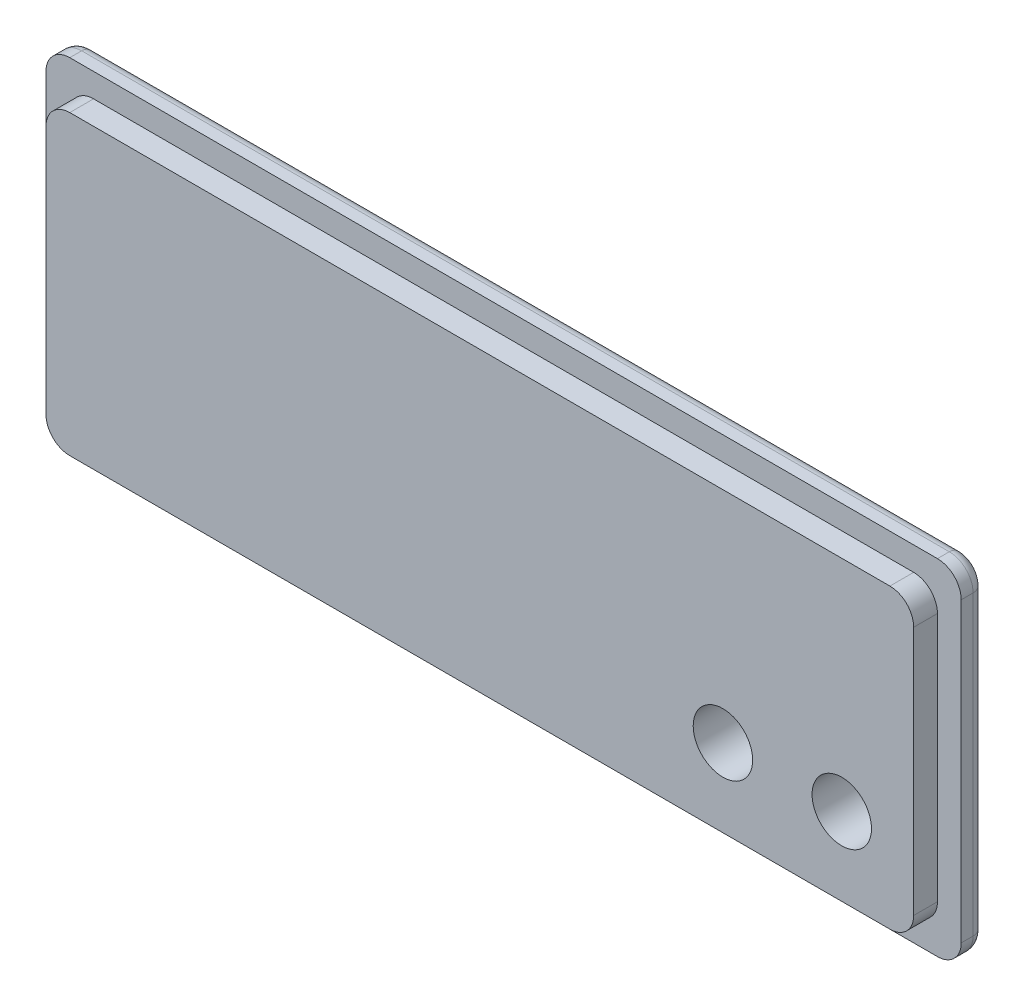
ISO-10303-21;
HEADER;
FILE_DESCRIPTION(('STEP AP214'),'2;1');
FILE_NAME('part.step','',(''),(''),'','','');
FILE_SCHEMA(('AUTOMOTIVE_DESIGN { 1 0 10303 214 1 1 1 1 }'));
ENDSEC;
DATA;
#1=APPLICATION_CONTEXT('core data for automotive mechanical design processes');
#2=APPLICATION_PROTOCOL_DEFINITION('international standard','automotive_design',2000,#1);
#3=PRODUCT_CONTEXT('',#1,'mechanical');
#4=PRODUCT('Part','Part','',(#3));
#5=PRODUCT_RELATED_PRODUCT_CATEGORY('part','',(#4));
#6=PRODUCT_DEFINITION_FORMATION('','',#4);
#7=PRODUCT_DEFINITION_CONTEXT('part definition',#1,'design');
#8=PRODUCT_DEFINITION('design','',#6,#7);
#9=PRODUCT_DEFINITION_SHAPE('','',#8);
#10=(LENGTH_UNIT() NAMED_UNIT(*) SI_UNIT(.MILLI.,.METRE.));
#11=(NAMED_UNIT(*) PLANE_ANGLE_UNIT() SI_UNIT($,.RADIAN.));
#12=(NAMED_UNIT(*) SI_UNIT($,.STERADIAN.) SOLID_ANGLE_UNIT());
#13=UNCERTAINTY_MEASURE_WITH_UNIT(LENGTH_MEASURE(1.E-05),#10,'distance_accuracy_value','');
#14=(GEOMETRIC_REPRESENTATION_CONTEXT(3) GLOBAL_UNCERTAINTY_ASSIGNED_CONTEXT((#13)) GLOBAL_UNIT_ASSIGNED_CONTEXT((#10,
#11,#12)) REPRESENTATION_CONTEXT('',''));
#15=CARTESIAN_POINT('',(0.,0.,0.));
#16=DIRECTION('',(0.,0.,1.));
#17=DIRECTION('',(1.,0.,0.));
#18=AXIS2_PLACEMENT_3D('',#15,#16,#17);
#19=CARTESIAN_POINT('',(36.5,-12.5,2.));
#20=DIRECTION('',(0.,0.,1.));
#21=DIRECTION('',(1.,0.,0.));
#22=AXIS2_PLACEMENT_3D('',#19,#20,#21);
#23=PLANE('',#22);
#24=CARTESIAN_POINT('',(36.5,-12.5,2.));
#25=DIRECTION('',(0.,0.,1.));
#26=DIRECTION('',(1.,0.,0.));
#27=AXIS2_PLACEMENT_3D('',#24,#25,#26);
#28=CIRCLE('',#27,2.);
#29=CARTESIAN_POINT('',(36.5,-14.5,2.));
#30=VERTEX_POINT('',#29);
#31=CARTESIAN_POINT('',(38.5,-12.5,2.));
#32=VERTEX_POINT('',#31);
#33=EDGE_CURVE('E197',#30,#32,#28,.T.);
#34=ORIENTED_EDGE('',*,*,#33,.T.);
#35=DIRECTION('',(0.,1.,0.));
#36=VECTOR('',#35,1.);
#37=CARTESIAN_POINT('',(38.5,-12.5,2.));
#38=LINE('',#37,#36);
#39=CARTESIAN_POINT('',(38.5,12.5,2.));
#40=VERTEX_POINT('',#39);
#41=EDGE_CURVE('E200',#32,#40,#38,.T.);
#42=ORIENTED_EDGE('',*,*,#41,.T.);
#43=CARTESIAN_POINT('',(36.5,12.5,2.));
#44=DIRECTION('',(0.,0.,1.));
#45=DIRECTION('',(1.,0.,0.));
#46=AXIS2_PLACEMENT_3D('',#43,#44,#45);
#47=CIRCLE('',#46,2.);
#48=CARTESIAN_POINT('',(36.5,14.5,2.));
#49=VERTEX_POINT('',#48);
#50=EDGE_CURVE('E207',#40,#49,#47,.T.);
#51=ORIENTED_EDGE('',*,*,#50,.T.);
#52=DIRECTION('',(-1.,0.,0.));
#53=VECTOR('',#52,1.);
#54=CARTESIAN_POINT('',(36.5,14.5,2.));
#55=LINE('',#54,#53);
#56=CARTESIAN_POINT('',(-36.5,14.5,2.));
#57=VERTEX_POINT('',#56);
#58=EDGE_CURVE('E209',#49,#57,#55,.T.);
#59=ORIENTED_EDGE('',*,*,#58,.T.);
#60=CARTESIAN_POINT('',(-36.5,12.5,2.));
#61=DIRECTION('',(0.,0.,1.));
#62=DIRECTION('',(1.,0.,0.));
#63=AXIS2_PLACEMENT_3D('',#60,#61,#62);
#64=CIRCLE('',#63,2.);
#65=CARTESIAN_POINT('',(-38.5,12.5,2.));
#66=VERTEX_POINT('',#65);
#67=EDGE_CURVE('E211',#57,#66,#64,.T.);
#68=ORIENTED_EDGE('',*,*,#67,.T.);
#69=DIRECTION('',(0.,-1.,0.));
#70=VECTOR('',#69,1.);
#71=CARTESIAN_POINT('',(-38.5,-12.5,2.));
#72=LINE('',#71,#70);
#73=CARTESIAN_POINT('',(-38.5,-12.5,2.));
#74=VERTEX_POINT('',#73);
#75=EDGE_CURVE('E213',#66,#74,#72,.T.);
#76=ORIENTED_EDGE('',*,*,#75,.T.);
#77=CARTESIAN_POINT('',(-36.5,-12.5,2.));
#78=DIRECTION('',(0.,0.,1.));
#79=DIRECTION('',(-1.,0.,0.));
#80=AXIS2_PLACEMENT_3D('',#77,#78,#79);
#81=CIRCLE('',#80,2.);
#82=CARTESIAN_POINT('',(-36.5,-14.5,2.));
#83=VERTEX_POINT('',#82);
#84=EDGE_CURVE('E215',#74,#83,#81,.T.);
#85=ORIENTED_EDGE('',*,*,#84,.T.);
#86=DIRECTION('',(1.,0.,0.));
#87=VECTOR('',#86,1.);
#88=CARTESIAN_POINT('',(36.5,-14.5,2.));
#89=LINE('',#88,#87);
#90=EDGE_CURVE('E217',#83,#30,#89,.T.);
#91=ORIENTED_EDGE('',*,*,#90,.T.);
#92=EDGE_LOOP('',(#34,#42,#51,#59,#68,#76,#85,#91));
#93=FACE_BOUND('',#92,.T.);
#94=DIRECTION('',(0.,1.,0.));
#95=VECTOR('',#94,1.);
#96=CARTESIAN_POINT('',(36.5,-10.5,2.));
#97=LINE('',#96,#95);
#98=CARTESIAN_POINT('',(36.5,-10.5,2.));
#99=VERTEX_POINT('',#98);
#100=CARTESIAN_POINT('',(36.5,10.5,2.));
#101=VERTEX_POINT('',#100);
#102=EDGE_CURVE('E324',#99,#101,#97,.T.);
#103=ORIENTED_EDGE('',*,*,#102,.F.);
#104=CARTESIAN_POINT('',(34.5,-10.5,2.));
#105=DIRECTION('',(0.,0.,1.));
#106=DIRECTION('',(1.,0.,0.));
#107=AXIS2_PLACEMENT_3D('',#104,#105,#106);
#108=CIRCLE('',#107,2.);
#109=CARTESIAN_POINT('',(34.5,-12.5,2.));
#110=VERTEX_POINT('',#109);
#111=EDGE_CURVE('E195',#110,#99,#108,.T.);
#112=ORIENTED_EDGE('',*,*,#111,.F.);
#113=DIRECTION('',(1.,0.,0.));
#114=VECTOR('',#113,1.);
#115=CARTESIAN_POINT('',(34.5,-12.5,2.));
#116=LINE('',#115,#114);
#117=CARTESIAN_POINT('',(-34.5,-12.5,2.));
#118=VERTEX_POINT('',#117);
#119=EDGE_CURVE('E191',#118,#110,#116,.T.);
#120=ORIENTED_EDGE('',*,*,#119,.F.);
#121=CARTESIAN_POINT('',(-34.5,-10.5,2.));
#122=DIRECTION('',(0.,0.,1.));
#123=DIRECTION('',(-1.,0.,0.));
#124=AXIS2_PLACEMENT_3D('',#121,#122,#123);
#125=CIRCLE('',#124,2.);
#126=CARTESIAN_POINT('',(-36.5,-10.5,2.));
#127=VERTEX_POINT('',#126);
#128=EDGE_CURVE('E334',#127,#118,#125,.T.);
#129=ORIENTED_EDGE('',*,*,#128,.F.);
#130=DIRECTION('',(0.,-1.,0.));
#131=VECTOR('',#130,1.);
#132=CARTESIAN_POINT('',(-36.5,-10.5,2.));
#133=LINE('',#132,#131);
#134=CARTESIAN_POINT('',(-36.5,10.5,2.));
#135=VERTEX_POINT('',#134);
#136=EDGE_CURVE('E332',#135,#127,#133,.T.);
#137=ORIENTED_EDGE('',*,*,#136,.F.);
#138=CARTESIAN_POINT('',(-34.5,10.5,2.));
#139=DIRECTION('',(0.,0.,1.));
#140=DIRECTION('',(1.,0.,0.));
#141=AXIS2_PLACEMENT_3D('',#138,#139,#140);
#142=CIRCLE('',#141,2.);
#143=CARTESIAN_POINT('',(-34.5,12.5,2.));
#144=VERTEX_POINT('',#143);
#145=EDGE_CURVE('E330',#144,#135,#142,.T.);
#146=ORIENTED_EDGE('',*,*,#145,.F.);
#147=DIRECTION('',(-1.,0.,0.));
#148=VECTOR('',#147,1.);
#149=CARTESIAN_POINT('',(34.5,12.5,2.));
#150=LINE('',#149,#148);
#151=CARTESIAN_POINT('',(34.5,12.5,2.));
#152=VERTEX_POINT('',#151);
#153=EDGE_CURVE('E328',#152,#144,#150,.T.);
#154=ORIENTED_EDGE('',*,*,#153,.F.);
#155=CARTESIAN_POINT('',(34.5,10.5,2.));
#156=DIRECTION('',(0.,0.,1.));
#157=DIRECTION('',(1.,0.,0.));
#158=AXIS2_PLACEMENT_3D('',#155,#156,#157);
#159=CIRCLE('',#158,2.);
#160=EDGE_CURVE('E326',#101,#152,#159,.T.);
#161=ORIENTED_EDGE('',*,*,#160,.F.);
#162=EDGE_LOOP('',(#103,#112,#120,#129,#137,#146,#154,#161));
#163=FACE_BOUND('',#162,.T.);
#164=ADVANCED_FACE('F33',(#93,#163),#23,.T.);
#165=CARTESIAN_POINT('',(36.5,-12.5,2.));
#166=DIRECTION('',(0.,0.,-1.));
#167=DIRECTION('',(-1.,0.,0.));
#168=AXIS2_PLACEMENT_3D('',#165,#166,#167);
#169=CYLINDRICAL_SURFACE('',#168,2.);
#170=DIRECTION('',(0.,0.,-1.));
#171=VECTOR('',#170,1.);
#172=CARTESIAN_POINT('',(36.5,-14.5,2.));
#173=LINE('',#172,#171);
#174=CARTESIAN_POINT('',(36.5,-14.5,1.));
#175=VERTEX_POINT('',#174);
#176=EDGE_CURVE('E219',#30,#175,#173,.T.);
#177=ORIENTED_EDGE('',*,*,#176,.T.);
#178=CARTESIAN_POINT('',(36.5,-12.5,1.));
#179=DIRECTION('',(0.,0.,1.));
#180=DIRECTION('',(1.,0.,0.));
#181=AXIS2_PLACEMENT_3D('',#178,#179,#180);
#182=CIRCLE('',#181,2.);
#183=CARTESIAN_POINT('',(38.5,-12.5,1.));
#184=VERTEX_POINT('',#183);
#185=EDGE_CURVE('E270',#175,#184,#182,.T.);
#186=ORIENTED_EDGE('',*,*,#185,.T.);
#187=DIRECTION('',(0.,0.,-1.));
#188=VECTOR('',#187,1.);
#189=CARTESIAN_POINT('',(38.5,-12.5,2.));
#190=LINE('',#189,#188);
#191=EDGE_CURVE('E237',#32,#184,#190,.T.);
#192=ORIENTED_EDGE('',*,*,#191,.F.);
#193=ORIENTED_EDGE('',*,*,#33,.F.);
#194=EDGE_LOOP('',(#177,#186,#192,#193));
#195=FACE_BOUND('',#194,.T.);
#196=ADVANCED_FACE('F382',(#195),#169,.T.);
#197=CARTESIAN_POINT('',(38.5,-12.5,2.));
#198=DIRECTION('',(-1.,0.,0.));
#199=DIRECTION('',(0.,0.,1.));
#200=AXIS2_PLACEMENT_3D('',#197,#198,#199);
#201=PLANE('',#200);
#202=ORIENTED_EDGE('',*,*,#191,.T.);
#203=DIRECTION('',(0.,1.,0.));
#204=VECTOR('',#203,1.);
#205=CARTESIAN_POINT('',(38.5,-12.5,1.));
#206=LINE('',#205,#204);
#207=CARTESIAN_POINT('',(38.5,12.5,1.));
#208=VERTEX_POINT('',#207);
#209=EDGE_CURVE('E268',#184,#208,#206,.T.);
#210=ORIENTED_EDGE('',*,*,#209,.T.);
#211=DIRECTION('',(0.,0.,-1.));
#212=VECTOR('',#211,1.);
#213=CARTESIAN_POINT('',(38.5,12.5,2.));
#214=LINE('',#213,#212);
#215=EDGE_CURVE('E234',#40,#208,#214,.T.);
#216=ORIENTED_EDGE('',*,*,#215,.F.);
#217=ORIENTED_EDGE('',*,*,#41,.F.);
#218=EDGE_LOOP('',(#202,#210,#216,#217));
#219=FACE_BOUND('',#218,.T.);
#220=ADVANCED_FACE('F389',(#219),#201,.F.);
#221=CARTESIAN_POINT('',(36.5,12.5,2.));
#222=DIRECTION('',(0.,0.,-1.));
#223=DIRECTION('',(-1.,0.,0.));
#224=AXIS2_PLACEMENT_3D('',#221,#222,#223);
#225=CYLINDRICAL_SURFACE('',#224,2.);
#226=ORIENTED_EDGE('',*,*,#215,.T.);
#227=CARTESIAN_POINT('',(36.5,12.5,1.));
#228=DIRECTION('',(0.,0.,1.));
#229=DIRECTION('',(1.,0.,0.));
#230=AXIS2_PLACEMENT_3D('',#227,#228,#229);
#231=CIRCLE('',#230,2.);
#232=CARTESIAN_POINT('',(36.5,14.5,1.));
#233=VERTEX_POINT('',#232);
#234=EDGE_CURVE('E240',#208,#233,#231,.T.);
#235=ORIENTED_EDGE('',*,*,#234,.T.);
#236=DIRECTION('',(0.,0.,-1.));
#237=VECTOR('',#236,1.);
#238=CARTESIAN_POINT('',(36.5,14.5,2.));
#239=LINE('',#238,#237);
#240=EDGE_CURVE('E232',#49,#233,#239,.T.);
#241=ORIENTED_EDGE('',*,*,#240,.F.);
#242=ORIENTED_EDGE('',*,*,#50,.F.);
#243=EDGE_LOOP('',(#226,#235,#241,#242));
#244=FACE_BOUND('',#243,.T.);
#245=ADVANCED_FACE('F416',(#244),#225,.T.);
#246=CARTESIAN_POINT('',(36.5,14.5,2.));
#247=DIRECTION('',(0.,-1.,0.));
#248=DIRECTION('',(1.,0.,0.));
#249=AXIS2_PLACEMENT_3D('',#246,#247,#248);
#250=PLANE('',#249);
#251=ORIENTED_EDGE('',*,*,#240,.T.);
#252=DIRECTION('',(-1.,0.,0.));
#253=VECTOR('',#252,1.);
#254=CARTESIAN_POINT('',(36.5,14.5,1.));
#255=LINE('',#254,#253);
#256=CARTESIAN_POINT('',(-36.5,14.5,1.));
#257=VERTEX_POINT('',#256);
#258=EDGE_CURVE('E11',#233,#257,#255,.T.);
#259=ORIENTED_EDGE('',*,*,#258,.T.);
#260=DIRECTION('',(0.,0.,-1.));
#261=VECTOR('',#260,1.);
#262=CARTESIAN_POINT('',(-36.5,14.5,2.));
#263=LINE('',#262,#261);
#264=EDGE_CURVE('E230',#57,#257,#263,.T.);
#265=ORIENTED_EDGE('',*,*,#264,.F.);
#266=ORIENTED_EDGE('',*,*,#58,.F.);
#267=EDGE_LOOP('',(#251,#259,#265,#266));
#268=FACE_BOUND('',#267,.T.);
#269=ADVANCED_FACE('F413',(#268),#250,.F.);
#270=CARTESIAN_POINT('',(-36.5,12.5,2.));
#271=DIRECTION('',(0.,0.,-1.));
#272=DIRECTION('',(-1.,0.,0.));
#273=AXIS2_PLACEMENT_3D('',#270,#271,#272);
#274=CYLINDRICAL_SURFACE('',#273,2.);
#275=ORIENTED_EDGE('',*,*,#264,.T.);
#276=CARTESIAN_POINT('',(-36.5,12.5,1.));
#277=DIRECTION('',(0.,0.,1.));
#278=DIRECTION('',(1.,0.,0.));
#279=AXIS2_PLACEMENT_3D('',#276,#277,#278);
#280=CIRCLE('',#279,2.);
#281=CARTESIAN_POINT('',(-38.5,12.5,1.));
#282=VERTEX_POINT('',#281);
#283=EDGE_CURVE('E42',#257,#282,#280,.T.);
#284=ORIENTED_EDGE('',*,*,#283,.T.);
#285=DIRECTION('',(0.,0.,-1.));
#286=VECTOR('',#285,1.);
#287=CARTESIAN_POINT('',(-38.5,12.5,2.));
#288=LINE('',#287,#286);
#289=EDGE_CURVE('E228',#66,#282,#288,.T.);
#290=ORIENTED_EDGE('',*,*,#289,.F.);
#291=ORIENTED_EDGE('',*,*,#67,.F.);
#292=EDGE_LOOP('',(#275,#284,#290,#291));
#293=FACE_BOUND('',#292,.T.);
#294=ADVANCED_FACE('F409',(#293),#274,.T.);
#295=CARTESIAN_POINT('',(-38.5,-12.5,2.));
#296=DIRECTION('',(1.,0.,0.));
#297=DIRECTION('',(0.,0.,-1.));
#298=AXIS2_PLACEMENT_3D('',#295,#296,#297);
#299=PLANE('',#298);
#300=ORIENTED_EDGE('',*,*,#289,.T.);
#301=DIRECTION('',(0.,-1.,0.));
#302=VECTOR('',#301,1.);
#303=CARTESIAN_POINT('',(-38.5,-12.5,1.));
#304=LINE('',#303,#302);
#305=CARTESIAN_POINT('',(-38.5,-12.5,1.));
#306=VERTEX_POINT('',#305);
#307=EDGE_CURVE('E276',#282,#306,#304,.T.);
#308=ORIENTED_EDGE('',*,*,#307,.T.);
#309=DIRECTION('',(0.,0.,-1.));
#310=VECTOR('',#309,1.);
#311=CARTESIAN_POINT('',(-38.5,-12.5,2.));
#312=LINE('',#311,#310);
#313=EDGE_CURVE('E225',#74,#306,#312,.T.);
#314=ORIENTED_EDGE('',*,*,#313,.F.);
#315=ORIENTED_EDGE('',*,*,#75,.F.);
#316=EDGE_LOOP('',(#300,#308,#314,#315));
#317=FACE_BOUND('',#316,.T.);
#318=ADVANCED_FACE('F405',(#317),#299,.F.);
#319=CARTESIAN_POINT('',(-36.5,-12.5,2.));
#320=DIRECTION('',(0.,0.,-1.));
#321=DIRECTION('',(-1.,0.,0.));
#322=AXIS2_PLACEMENT_3D('',#319,#320,#321);
#323=CYLINDRICAL_SURFACE('',#322,2.);
#324=ORIENTED_EDGE('',*,*,#313,.T.);
#325=CARTESIAN_POINT('',(-36.5,-12.5,1.));
#326=DIRECTION('',(0.,0.,1.));
#327=DIRECTION('',(1.,0.,0.));
#328=AXIS2_PLACEMENT_3D('',#325,#326,#327);
#329=CIRCLE('',#328,2.);
#330=CARTESIAN_POINT('',(-36.5,-14.5,1.));
#331=VERTEX_POINT('',#330);
#332=EDGE_CURVE('E274',#306,#331,#329,.T.);
#333=ORIENTED_EDGE('',*,*,#332,.T.);
#334=DIRECTION('',(0.,0.,-1.));
#335=VECTOR('',#334,1.);
#336=CARTESIAN_POINT('',(-36.5,-14.5,2.));
#337=LINE('',#336,#335);
#338=EDGE_CURVE('E222',#83,#331,#337,.T.);
#339=ORIENTED_EDGE('',*,*,#338,.F.);
#340=ORIENTED_EDGE('',*,*,#84,.F.);
#341=EDGE_LOOP('',(#324,#333,#339,#340));
#342=FACE_BOUND('',#341,.T.);
#343=ADVANCED_FACE('F401',(#342),#323,.T.);
#344=CARTESIAN_POINT('',(36.5,-14.5,2.));
#345=DIRECTION('',(0.,1.,0.));
#346=DIRECTION('',(-1.,0.,0.));
#347=AXIS2_PLACEMENT_3D('',#344,#345,#346);
#348=PLANE('',#347);
#349=ORIENTED_EDGE('',*,*,#338,.T.);
#350=DIRECTION('',(1.,0.,0.));
#351=VECTOR('',#350,1.);
#352=CARTESIAN_POINT('',(36.5,-14.5,1.));
#353=LINE('',#352,#351);
#354=EDGE_CURVE('E272',#331,#175,#353,.T.);
#355=ORIENTED_EDGE('',*,*,#354,.T.);
#356=ORIENTED_EDGE('',*,*,#176,.F.);
#357=ORIENTED_EDGE('',*,*,#90,.F.);
#358=EDGE_LOOP('',(#349,#355,#356,#357));
#359=FACE_BOUND('',#358,.T.);
#360=ADVANCED_FACE('F397',(#359),#348,.F.);
#361=CARTESIAN_POINT('',(36.5,-12.5,0.));
#362=DIRECTION('',(0.,0.,1.));
#363=DIRECTION('',(1.,0.,0.));
#364=AXIS2_PLACEMENT_3D('',#361,#362,#363);
#365=PLANE('',#364);
#366=DIRECTION('',(-1.,0.,0.));
#367=VECTOR('',#366,1.);
#368=CARTESIAN_POINT('',(36.5,13.5,0.));
#369=LINE('',#368,#367);
#370=CARTESIAN_POINT('',(-36.5,13.5,0.));
#371=VERTEX_POINT('',#370);
#372=CARTESIAN_POINT('',(36.5,13.5,0.));
#373=VERTEX_POINT('',#372);
#374=EDGE_CURVE('E251',#371,#373,#369,.F.);
#375=ORIENTED_EDGE('',*,*,#374,.T.);
#376=CARTESIAN_POINT('',(36.5,12.5,0.));
#377=DIRECTION('',(0.,0.,1.));
#378=DIRECTION('',(1.,0.,0.));
#379=AXIS2_PLACEMENT_3D('',#376,#377,#378);
#380=CIRCLE('',#379,1.);
#381=CARTESIAN_POINT('',(37.5,12.5,0.));
#382=VERTEX_POINT('',#381);
#383=EDGE_CURVE('E265',#373,#382,#380,.F.);
#384=ORIENTED_EDGE('',*,*,#383,.T.);
#385=DIRECTION('',(0.,1.,0.));
#386=VECTOR('',#385,1.);
#387=CARTESIAN_POINT('',(37.5,-12.5,0.));
#388=LINE('',#387,#386);
#389=CARTESIAN_POINT('',(37.5,-12.5,0.));
#390=VERTEX_POINT('',#389);
#391=EDGE_CURVE('E263',#382,#390,#388,.F.);
#392=ORIENTED_EDGE('',*,*,#391,.T.);
#393=CARTESIAN_POINT('',(36.5,-12.5,0.));
#394=DIRECTION('',(0.,0.,1.));
#395=DIRECTION('',(1.,0.,0.));
#396=AXIS2_PLACEMENT_3D('',#393,#394,#395);
#397=CIRCLE('',#396,1.);
#398=CARTESIAN_POINT('',(36.5,-13.5,0.));
#399=VERTEX_POINT('',#398);
#400=EDGE_CURVE('E261',#390,#399,#397,.F.);
#401=ORIENTED_EDGE('',*,*,#400,.T.);
#402=DIRECTION('',(1.,0.,0.));
#403=VECTOR('',#402,1.);
#404=CARTESIAN_POINT('',(36.5,-13.5,0.));
#405=LINE('',#404,#403);
#406=CARTESIAN_POINT('',(-36.5,-13.5,0.));
#407=VERTEX_POINT('',#406);
#408=EDGE_CURVE('E259',#399,#407,#405,.F.);
#409=ORIENTED_EDGE('',*,*,#408,.T.);
#410=CARTESIAN_POINT('',(-36.5,-12.5,0.));
#411=DIRECTION('',(0.,0.,1.));
#412=DIRECTION('',(1.,0.,0.));
#413=AXIS2_PLACEMENT_3D('',#410,#411,#412);
#414=CIRCLE('',#413,1.);
#415=CARTESIAN_POINT('',(-37.5,-12.5,0.));
#416=VERTEX_POINT('',#415);
#417=EDGE_CURVE('E257',#407,#416,#414,.F.);
#418=ORIENTED_EDGE('',*,*,#417,.T.);
#419=DIRECTION('',(0.,-1.,0.));
#420=VECTOR('',#419,1.);
#421=CARTESIAN_POINT('',(-37.5,-12.5,0.));
#422=LINE('',#421,#420);
#423=CARTESIAN_POINT('',(-37.5,12.5,0.));
#424=VERTEX_POINT('',#423);
#425=EDGE_CURVE('E255',#416,#424,#422,.F.);
#426=ORIENTED_EDGE('',*,*,#425,.T.);
#427=CARTESIAN_POINT('',(-36.5,12.5,0.));
#428=DIRECTION('',(0.,0.,1.));
#429=DIRECTION('',(1.,0.,0.));
#430=AXIS2_PLACEMENT_3D('',#427,#428,#429);
#431=CIRCLE('',#430,1.);
#432=EDGE_CURVE('E253',#424,#371,#431,.F.);
#433=ORIENTED_EDGE('',*,*,#432,.T.);
#434=EDGE_LOOP('',(#375,#384,#392,#401,#409,#418,#426,#433));
#435=FACE_BOUND('',#434,.T.);
#436=CARTESIAN_POINT('',(20.4504123229259,-5.95224109192974,0.));
#437=DIRECTION('',(0.,0.,-1.));
#438=DIRECTION('',(-1.,0.,0.));
#439=AXIS2_PLACEMENT_3D('',#436,#437,#438);
#440=CIRCLE('',#439,2.5);
#441=CARTESIAN_POINT('',(17.9504123229259,-5.95224109192974,0.));
#442=VERTEX_POINT('',#441);
#443=EDGE_CURVE('E248',#442,#442,#440,.T.);
#444=ORIENTED_EDGE('',*,*,#443,.F.);
#445=EDGE_LOOP('',(#444));
#446=FACE_BOUND('',#445,.T.);
#447=CARTESIAN_POINT('',(30.4504123229259,-5.95224109192974,0.));
#448=DIRECTION('',(0.,0.,-1.));
#449=DIRECTION('',(-1.,0.,0.));
#450=AXIS2_PLACEMENT_3D('',#447,#448,#449);
#451=CIRCLE('',#450,2.5);
#452=CARTESIAN_POINT('',(27.9504123229259,-5.95224109192974,0.));
#453=VERTEX_POINT('',#452);
#454=EDGE_CURVE('E244',#453,#453,#451,.T.);
#455=ORIENTED_EDGE('',*,*,#454,.F.);
#456=EDGE_LOOP('',(#455));
#457=FACE_BOUND('',#456,.T.);
#458=ADVANCED_FACE('F394',(#435,#446,#457),#365,.F.);
#459=CARTESIAN_POINT('',(34.5,-10.5,4.));
#460=DIRECTION('',(0.,0.,-1.));
#461=DIRECTION('',(-1.,0.,0.));
#462=AXIS2_PLACEMENT_3D('',#459,#460,#461);
#463=CYLINDRICAL_SURFACE('',#462,2.);
#464=ORIENTED_EDGE('',*,*,#111,.T.);
#465=DIRECTION('',(0.,0.,-1.));
#466=VECTOR('',#465,1.);
#467=CARTESIAN_POINT('',(36.5,-10.5,4.));
#468=LINE('',#467,#466);
#469=CARTESIAN_POINT('',(36.5,-10.5,4.));
#470=VERTEX_POINT('',#469);
#471=EDGE_CURVE('E175',#470,#99,#468,.T.);
#472=ORIENTED_EDGE('',*,*,#471,.F.);
#473=CARTESIAN_POINT('',(34.5,-10.5,4.));
#474=DIRECTION('',(0.,0.,1.));
#475=DIRECTION('',(1.,0.,0.));
#476=AXIS2_PLACEMENT_3D('',#473,#474,#475);
#477=CIRCLE('',#476,2.);
#478=CARTESIAN_POINT('',(34.5,-12.5,4.));
#479=VERTEX_POINT('',#478);
#480=EDGE_CURVE('E182',#479,#470,#477,.T.);
#481=ORIENTED_EDGE('',*,*,#480,.F.);
#482=DIRECTION('',(0.,0.,-1.));
#483=VECTOR('',#482,1.);
#484=CARTESIAN_POINT('',(34.5,-12.5,4.));
#485=LINE('',#484,#483);
#486=EDGE_CURVE('E322',#479,#110,#485,.T.);
#487=ORIENTED_EDGE('',*,*,#486,.T.);
#488=EDGE_LOOP('',(#464,#472,#481,#487));
#489=FACE_BOUND('',#488,.T.);
#490=ADVANCED_FACE('F193',(#489),#463,.T.);
#491=CARTESIAN_POINT('',(36.5,-10.5,4.));
#492=DIRECTION('',(-1.,0.,0.));
#493=DIRECTION('',(0.,0.,1.));
#494=AXIS2_PLACEMENT_3D('',#491,#492,#493);
#495=PLANE('',#494);
#496=ORIENTED_EDGE('',*,*,#102,.T.);
#497=DIRECTION('',(0.,0.,-1.));
#498=VECTOR('',#497,1.);
#499=CARTESIAN_POINT('',(36.5,10.5,4.));
#500=LINE('',#499,#498);
#501=CARTESIAN_POINT('',(36.5,10.5,4.));
#502=VERTEX_POINT('',#501);
#503=EDGE_CURVE('E178',#502,#101,#500,.T.);
#504=ORIENTED_EDGE('',*,*,#503,.F.);
#505=DIRECTION('',(0.,1.,0.));
#506=VECTOR('',#505,1.);
#507=CARTESIAN_POINT('',(36.5,-10.5,4.));
#508=LINE('',#507,#506);
#509=EDGE_CURVE('E171',#470,#502,#508,.T.);
#510=ORIENTED_EDGE('',*,*,#509,.F.);
#511=ORIENTED_EDGE('',*,*,#471,.T.);
#512=EDGE_LOOP('',(#496,#504,#510,#511));
#513=FACE_BOUND('',#512,.T.);
#514=ADVANCED_FACE('F173',(#513),#495,.F.);
#515=CARTESIAN_POINT('',(34.5,10.5,4.));
#516=DIRECTION('',(0.,0.,-1.));
#517=DIRECTION('',(-1.,0.,0.));
#518=AXIS2_PLACEMENT_3D('',#515,#516,#517);
#519=CYLINDRICAL_SURFACE('',#518,2.);
#520=ORIENTED_EDGE('',*,*,#160,.T.);
#521=DIRECTION('',(0.,0.,-1.));
#522=VECTOR('',#521,1.);
#523=CARTESIAN_POINT('',(34.5,12.5,4.));
#524=LINE('',#523,#522);
#525=CARTESIAN_POINT('',(34.5,12.5,4.));
#526=VERTEX_POINT('',#525);
#527=EDGE_CURVE('E202',#526,#152,#524,.T.);
#528=ORIENTED_EDGE('',*,*,#527,.F.);
#529=CARTESIAN_POINT('',(34.5,10.5,4.));
#530=DIRECTION('',(0.,0.,1.));
#531=DIRECTION('',(1.,0.,0.));
#532=AXIS2_PLACEMENT_3D('',#529,#530,#531);
#533=CIRCLE('',#532,2.);
#534=EDGE_CURVE('E181',#502,#526,#533,.T.);
#535=ORIENTED_EDGE('',*,*,#534,.F.);
#536=ORIENTED_EDGE('',*,*,#503,.T.);
#537=EDGE_LOOP('',(#520,#528,#535,#536));
#538=FACE_BOUND('',#537,.T.);
#539=ADVANCED_FACE('F372',(#538),#519,.T.);
#540=CARTESIAN_POINT('',(34.5,12.5,4.));
#541=DIRECTION('',(0.,-1.,0.));
#542=DIRECTION('',(1.,0.,0.));
#543=AXIS2_PLACEMENT_3D('',#540,#541,#542);
#544=PLANE('',#543);
#545=ORIENTED_EDGE('',*,*,#153,.T.);
#546=DIRECTION('',(0.,0.,-1.));
#547=VECTOR('',#546,1.);
#548=CARTESIAN_POINT('',(-34.5,12.5,4.));
#549=LINE('',#548,#547);
#550=CARTESIAN_POINT('',(-34.5,12.5,4.));
#551=VERTEX_POINT('',#550);
#552=EDGE_CURVE('E347',#551,#144,#549,.T.);
#553=ORIENTED_EDGE('',*,*,#552,.F.);
#554=DIRECTION('',(-1.,0.,0.));
#555=VECTOR('',#554,1.);
#556=CARTESIAN_POINT('',(34.5,12.5,4.));
#557=LINE('',#556,#555);
#558=EDGE_CURVE('E313',#526,#551,#557,.T.);
#559=ORIENTED_EDGE('',*,*,#558,.F.);
#560=ORIENTED_EDGE('',*,*,#527,.T.);
#561=EDGE_LOOP('',(#545,#553,#559,#560));
#562=FACE_BOUND('',#561,.T.);
#563=ADVANCED_FACE('F354',(#562),#544,.F.);
#564=CARTESIAN_POINT('',(-34.5,10.5,4.));
#565=DIRECTION('',(0.,0.,-1.));
#566=DIRECTION('',(-1.,0.,0.));
#567=AXIS2_PLACEMENT_3D('',#564,#565,#566);
#568=CYLINDRICAL_SURFACE('',#567,2.);
#569=ORIENTED_EDGE('',*,*,#145,.T.);
#570=DIRECTION('',(0.,0.,-1.));
#571=VECTOR('',#570,1.);
#572=CARTESIAN_POINT('',(-36.5,10.5,4.));
#573=LINE('',#572,#571);
#574=CARTESIAN_POINT('',(-36.5,10.5,4.));
#575=VERTEX_POINT('',#574);
#576=EDGE_CURVE('E344',#575,#135,#573,.T.);
#577=ORIENTED_EDGE('',*,*,#576,.F.);
#578=CARTESIAN_POINT('',(-34.5,10.5,4.));
#579=DIRECTION('',(0.,0.,1.));
#580=DIRECTION('',(1.,0.,0.));
#581=AXIS2_PLACEMENT_3D('',#578,#579,#580);
#582=CIRCLE('',#581,2.);
#583=EDGE_CURVE('E315',#551,#575,#582,.T.);
#584=ORIENTED_EDGE('',*,*,#583,.F.);
#585=ORIENTED_EDGE('',*,*,#552,.T.);
#586=EDGE_LOOP('',(#569,#577,#584,#585));
#587=FACE_BOUND('',#586,.T.);
#588=ADVANCED_FACE('F364',(#587),#568,.T.);
#589=CARTESIAN_POINT('',(-36.5,-10.5,4.));
#590=DIRECTION('',(1.,0.,0.));
#591=DIRECTION('',(0.,0.,-1.));
#592=AXIS2_PLACEMENT_3D('',#589,#590,#591);
#593=PLANE('',#592);
#594=ORIENTED_EDGE('',*,*,#136,.T.);
#595=DIRECTION('',(0.,0.,-1.));
#596=VECTOR('',#595,1.);
#597=CARTESIAN_POINT('',(-36.5,-10.5,4.));
#598=LINE('',#597,#596);
#599=CARTESIAN_POINT('',(-36.5,-10.5,4.));
#600=VERTEX_POINT('',#599);
#601=EDGE_CURVE('E341',#600,#127,#598,.T.);
#602=ORIENTED_EDGE('',*,*,#601,.F.);
#603=DIRECTION('',(0.,-1.,0.));
#604=VECTOR('',#603,1.);
#605=CARTESIAN_POINT('',(-36.5,-10.5,4.));
#606=LINE('',#605,#604);
#607=EDGE_CURVE('E317',#575,#600,#606,.T.);
#608=ORIENTED_EDGE('',*,*,#607,.F.);
#609=ORIENTED_EDGE('',*,*,#576,.T.);
#610=EDGE_LOOP('',(#594,#602,#608,#609));
#611=FACE_BOUND('',#610,.T.);
#612=ADVANCED_FACE('F368',(#611),#593,.F.);
#613=CARTESIAN_POINT('',(-34.5,-10.5,4.));
#614=DIRECTION('',(0.,0.,-1.));
#615=DIRECTION('',(-1.,0.,0.));
#616=AXIS2_PLACEMENT_3D('',#613,#614,#615);
#617=CYLINDRICAL_SURFACE('',#616,2.);
#618=ORIENTED_EDGE('',*,*,#128,.T.);
#619=DIRECTION('',(0.,0.,-1.));
#620=VECTOR('',#619,1.);
#621=CARTESIAN_POINT('',(-34.5,-12.5,4.));
#622=LINE('',#621,#620);
#623=CARTESIAN_POINT('',(-34.5,-12.5,4.));
#624=VERTEX_POINT('',#623);
#625=EDGE_CURVE('E339',#624,#118,#622,.T.);
#626=ORIENTED_EDGE('',*,*,#625,.F.);
#627=CARTESIAN_POINT('',(-34.5,-10.5,4.));
#628=DIRECTION('',(0.,0.,1.));
#629=DIRECTION('',(-1.,0.,0.));
#630=AXIS2_PLACEMENT_3D('',#627,#628,#629);
#631=CIRCLE('',#630,2.);
#632=EDGE_CURVE('E319',#600,#624,#631,.T.);
#633=ORIENTED_EDGE('',*,*,#632,.F.);
#634=ORIENTED_EDGE('',*,*,#601,.T.);
#635=EDGE_LOOP('',(#618,#626,#633,#634));
#636=FACE_BOUND('',#635,.T.);
#637=ADVANCED_FACE('F504',(#636),#617,.T.);
#638=CARTESIAN_POINT('',(34.5,-12.5,4.));
#639=DIRECTION('',(0.,1.,0.));
#640=DIRECTION('',(-1.,0.,0.));
#641=AXIS2_PLACEMENT_3D('',#638,#639,#640);
#642=PLANE('',#641);
#643=ORIENTED_EDGE('',*,*,#119,.T.);
#644=ORIENTED_EDGE('',*,*,#486,.F.);
#645=DIRECTION('',(1.,0.,0.));
#646=VECTOR('',#645,1.);
#647=CARTESIAN_POINT('',(34.5,-12.5,4.));
#648=LINE('',#647,#646);
#649=EDGE_CURVE('E187',#624,#479,#648,.T.);
#650=ORIENTED_EDGE('',*,*,#649,.F.);
#651=ORIENTED_EDGE('',*,*,#625,.T.);
#652=EDGE_LOOP('',(#643,#644,#650,#651));
#653=FACE_BOUND('',#652,.T.);
#654=ADVANCED_FACE('F498',(#653),#642,.F.);
#655=CARTESIAN_POINT('',(34.5,-10.5,4.));
#656=DIRECTION('',(0.,0.,1.));
#657=DIRECTION('',(1.,0.,0.));
#658=AXIS2_PLACEMENT_3D('',#655,#656,#657);
#659=PLANE('',#658);
#660=CARTESIAN_POINT('',(20.4504123229259,-5.95224109192974,4.));
#661=DIRECTION('',(0.,0.,1.));
#662=DIRECTION('',(1.,0.,0.));
#663=AXIS2_PLACEMENT_3D('',#660,#661,#662);
#664=CIRCLE('',#663,2.5);
#665=CARTESIAN_POINT('',(22.9504123229259,-5.95224109192974,4.));
#666=VERTEX_POINT('',#665);
#667=EDGE_CURVE('E245',#666,#666,#664,.T.);
#668=ORIENTED_EDGE('',*,*,#667,.F.);
#669=EDGE_LOOP('',(#668));
#670=FACE_BOUND('',#669,.T.);
#671=CARTESIAN_POINT('',(30.4504123229259,-5.95224109192974,4.));
#672=DIRECTION('',(0.,0.,1.));
#673=DIRECTION('',(1.,0.,0.));
#674=AXIS2_PLACEMENT_3D('',#671,#672,#673);
#675=CIRCLE('',#674,2.5);
#676=CARTESIAN_POINT('',(32.9504123229259,-5.95224109192974,4.));
#677=VERTEX_POINT('',#676);
#678=EDGE_CURVE('E241',#677,#677,#675,.T.);
#679=ORIENTED_EDGE('',*,*,#678,.F.);
#680=EDGE_LOOP('',(#679));
#681=FACE_BOUND('',#680,.T.);
#682=ORIENTED_EDGE('',*,*,#480,.T.);
#683=ORIENTED_EDGE('',*,*,#509,.T.);
#684=ORIENTED_EDGE('',*,*,#534,.T.);
#685=ORIENTED_EDGE('',*,*,#558,.T.);
#686=ORIENTED_EDGE('',*,*,#583,.T.);
#687=ORIENTED_EDGE('',*,*,#607,.T.);
#688=ORIENTED_EDGE('',*,*,#632,.T.);
#689=ORIENTED_EDGE('',*,*,#649,.T.);
#690=EDGE_LOOP('',(#682,#683,#684,#685,#686,#687,#688,#689));
#691=FACE_BOUND('',#690,.T.);
#692=ADVANCED_FACE('F185',(#670,#681,#691),#659,.T.);
#693=CARTESIAN_POINT('',(30.4504123229259,-5.95224109192974,10.));
#694=DIRECTION('',(0.,0.,-1.));
#695=DIRECTION('',(-1.,0.,0.));
#696=AXIS2_PLACEMENT_3D('',#693,#694,#695);
#697=CYLINDRICAL_SURFACE('',#696,2.5);
#698=ORIENTED_EDGE('',*,*,#678,.T.);
#699=EDGE_LOOP('',(#698));
#700=FACE_BOUND('',#699,.T.);
#701=ORIENTED_EDGE('',*,*,#454,.T.);
#702=EDGE_LOOP('',(#701));
#703=FACE_BOUND('',#702,.T.);
#704=ADVANCED_FACE('F455',(#700,#703),#697,.F.);
#705=CARTESIAN_POINT('',(20.4504123229259,-5.95224109192974,10.));
#706=DIRECTION('',(0.,0.,-1.));
#707=DIRECTION('',(-1.,0.,0.));
#708=AXIS2_PLACEMENT_3D('',#705,#706,#707);
#709=CYLINDRICAL_SURFACE('',#708,2.5);
#710=ORIENTED_EDGE('',*,*,#667,.T.);
#711=EDGE_LOOP('',(#710));
#712=FACE_BOUND('',#711,.T.);
#713=ORIENTED_EDGE('',*,*,#443,.T.);
#714=EDGE_LOOP('',(#713));
#715=FACE_BOUND('',#714,.T.);
#716=ADVANCED_FACE('F450',(#712,#715),#709,.F.);
#717=CARTESIAN_POINT('',(-36.5,-12.5,1.));
#718=DIRECTION('',(0.,0.,1.));
#719=DIRECTION('',(1.,0.,0.));
#720=AXIS2_PLACEMENT_3D('',#717,#718,#719);
#721=TOROIDAL_SURFACE('',#720,1.,1.);
#722=CARTESIAN_POINT('',(-37.5,-12.5,1.));
#723=DIRECTION('',(0.,1.,0.));
#724=DIRECTION('',(0.,0.,1.));
#725=AXIS2_PLACEMENT_3D('',#722,#723,#724);
#726=CIRCLE('',#725,1.);
#727=EDGE_CURVE('E294',#416,#306,#726,.T.);
#728=ORIENTED_EDGE('',*,*,#727,.F.);
#729=ORIENTED_EDGE('',*,*,#417,.F.);
#730=CARTESIAN_POINT('',(-36.5,-13.5,1.));
#731=DIRECTION('',(1.,0.,0.));
#732=DIRECTION('',(0.,1.,0.));
#733=AXIS2_PLACEMENT_3D('',#730,#731,#732);
#734=CIRCLE('',#733,1.);
#735=EDGE_CURVE('E37',#331,#407,#734,.T.);
#736=ORIENTED_EDGE('',*,*,#735,.F.);
#737=ORIENTED_EDGE('',*,*,#332,.F.);
#738=EDGE_LOOP('',(#728,#729,#736,#737));
#739=FACE_BOUND('',#738,.T.);
#740=ADVANCED_FACE('F35',(#739),#721,.T.);
#741=CARTESIAN_POINT('',(36.5,-13.5,1.));
#742=DIRECTION('',(1.,0.,0.));
#743=DIRECTION('',(0.,1.,0.));
#744=AXIS2_PLACEMENT_3D('',#741,#742,#743);
#745=CYLINDRICAL_SURFACE('',#744,1.);
#746=ORIENTED_EDGE('',*,*,#735,.T.);
#747=ORIENTED_EDGE('',*,*,#408,.F.);
#748=CARTESIAN_POINT('',(36.5,-13.5,1.));
#749=DIRECTION('',(1.,0.,0.));
#750=DIRECTION('',(0.,0.,-1.));
#751=AXIS2_PLACEMENT_3D('',#748,#749,#750);
#752=CIRCLE('',#751,1.);
#753=EDGE_CURVE('E292',#175,#399,#752,.T.);
#754=ORIENTED_EDGE('',*,*,#753,.F.);
#755=ORIENTED_EDGE('',*,*,#354,.F.);
#756=EDGE_LOOP('',(#746,#747,#754,#755));
#757=FACE_BOUND('',#756,.T.);
#758=ADVANCED_FACE('F445',(#757),#745,.T.);
#759=CARTESIAN_POINT('',(-37.5,-12.5,1.));
#760=DIRECTION('',(0.,-1.,0.));
#761=DIRECTION('',(0.,0.,-1.));
#762=AXIS2_PLACEMENT_3D('',#759,#760,#761);
#763=CYLINDRICAL_SURFACE('',#762,1.);
#764=ORIENTED_EDGE('',*,*,#727,.T.);
#765=ORIENTED_EDGE('',*,*,#307,.F.);
#766=CARTESIAN_POINT('',(-37.5,12.5,1.));
#767=DIRECTION('',(0.,1.,0.));
#768=DIRECTION('',(0.,0.,1.));
#769=AXIS2_PLACEMENT_3D('',#766,#767,#768);
#770=CIRCLE('',#769,1.);
#771=EDGE_CURVE('E289',#424,#282,#770,.T.);
#772=ORIENTED_EDGE('',*,*,#771,.F.);
#773=ORIENTED_EDGE('',*,*,#425,.F.);
#774=EDGE_LOOP('',(#764,#765,#772,#773));
#775=FACE_BOUND('',#774,.T.);
#776=ADVANCED_FACE('F442',(#775),#763,.T.);
#777=CARTESIAN_POINT('',(36.5,-12.5,1.));
#778=DIRECTION('',(0.,0.,1.));
#779=DIRECTION('',(1.,0.,0.));
#780=AXIS2_PLACEMENT_3D('',#777,#778,#779);
#781=TOROIDAL_SURFACE('',#780,1.,1.);
#782=ORIENTED_EDGE('',*,*,#753,.T.);
#783=ORIENTED_EDGE('',*,*,#400,.F.);
#784=CARTESIAN_POINT('',(37.5,-12.5,1.));
#785=DIRECTION('',(0.,1.,0.));
#786=DIRECTION('',(0.,0.,1.));
#787=AXIS2_PLACEMENT_3D('',#784,#785,#786);
#788=CIRCLE('',#787,1.);
#789=EDGE_CURVE('E286',#184,#390,#788,.T.);
#790=ORIENTED_EDGE('',*,*,#789,.F.);
#791=ORIENTED_EDGE('',*,*,#185,.F.);
#792=EDGE_LOOP('',(#782,#783,#790,#791));
#793=FACE_BOUND('',#792,.T.);
#794=ADVANCED_FACE('F438',(#793),#781,.T.);
#795=CARTESIAN_POINT('',(-36.5,12.5,1.));
#796=DIRECTION('',(0.,0.,1.));
#797=DIRECTION('',(1.,0.,0.));
#798=AXIS2_PLACEMENT_3D('',#795,#796,#797);
#799=TOROIDAL_SURFACE('',#798,1.,1.);
#800=ORIENTED_EDGE('',*,*,#771,.T.);
#801=ORIENTED_EDGE('',*,*,#283,.F.);
#802=CARTESIAN_POINT('',(-36.5,13.5,1.));
#803=DIRECTION('',(1.,0.,0.));
#804=DIRECTION('',(0.,1.,0.));
#805=AXIS2_PLACEMENT_3D('',#802,#803,#804);
#806=CIRCLE('',#805,1.);
#807=EDGE_CURVE('E283',#371,#257,#806,.T.);
#808=ORIENTED_EDGE('',*,*,#807,.F.);
#809=ORIENTED_EDGE('',*,*,#432,.F.);
#810=EDGE_LOOP('',(#800,#801,#808,#809));
#811=FACE_BOUND('',#810,.T.);
#812=ADVANCED_FACE('F434',(#811),#799,.T.);
#813=CARTESIAN_POINT('',(37.5,-12.5,1.));
#814=DIRECTION('',(0.,1.,0.));
#815=DIRECTION('',(0.,0.,1.));
#816=AXIS2_PLACEMENT_3D('',#813,#814,#815);
#817=CYLINDRICAL_SURFACE('',#816,1.);
#818=ORIENTED_EDGE('',*,*,#789,.T.);
#819=ORIENTED_EDGE('',*,*,#391,.F.);
#820=CARTESIAN_POINT('',(37.5,12.5,1.));
#821=DIRECTION('',(0.,1.,0.));
#822=DIRECTION('',(0.,0.,1.));
#823=AXIS2_PLACEMENT_3D('',#820,#821,#822);
#824=CIRCLE('',#823,1.);
#825=EDGE_CURVE('E281',#208,#382,#824,.T.);
#826=ORIENTED_EDGE('',*,*,#825,.F.);
#827=ORIENTED_EDGE('',*,*,#209,.F.);
#828=EDGE_LOOP('',(#818,#819,#826,#827));
#829=FACE_BOUND('',#828,.T.);
#830=ADVANCED_FACE('F430',(#829),#817,.T.);
#831=CARTESIAN_POINT('',(36.5,13.5,1.));
#832=DIRECTION('',(-1.,0.,0.));
#833=DIRECTION('',(0.,-1.,0.));
#834=AXIS2_PLACEMENT_3D('',#831,#832,#833);
#835=CYLINDRICAL_SURFACE('',#834,1.);
#836=ORIENTED_EDGE('',*,*,#807,.T.);
#837=ORIENTED_EDGE('',*,*,#258,.F.);
#838=CARTESIAN_POINT('',(36.5,13.5,1.));
#839=DIRECTION('',(1.,0.,0.));
#840=DIRECTION('',(0.,1.,0.));
#841=AXIS2_PLACEMENT_3D('',#838,#839,#840);
#842=CIRCLE('',#841,1.);
#843=EDGE_CURVE('E279',#373,#233,#842,.T.);
#844=ORIENTED_EDGE('',*,*,#843,.F.);
#845=ORIENTED_EDGE('',*,*,#374,.F.);
#846=EDGE_LOOP('',(#836,#837,#844,#845));
#847=FACE_BOUND('',#846,.T.);
#848=ADVANCED_FACE('F426',(#847),#835,.T.);
#849=CARTESIAN_POINT('',(36.5,12.5,1.));
#850=DIRECTION('',(0.,0.,1.));
#851=DIRECTION('',(1.,0.,0.));
#852=AXIS2_PLACEMENT_3D('',#849,#850,#851);
#853=TOROIDAL_SURFACE('',#852,1.,1.);
#854=ORIENTED_EDGE('',*,*,#825,.T.);
#855=ORIENTED_EDGE('',*,*,#383,.F.);
#856=ORIENTED_EDGE('',*,*,#843,.T.);
#857=ORIENTED_EDGE('',*,*,#234,.F.);
#858=EDGE_LOOP('',(#854,#855,#856,#857));
#859=FACE_BOUND('',#858,.T.);
#860=ADVANCED_FACE('F423',(#859),#853,.T.);
#861=CLOSED_SHELL('',(#164,#196,#220,#245,#269,#294,#318,#343,#360,#458,#490,#514,#539,#563,
#588,#612,#637,#654,#692,#704,#716,#740,#758,#776,#794,#812,#830,#848,#860));
#862=MANIFOLD_SOLID_BREP('B2',#861);
#863=ADVANCED_BREP_SHAPE_REPRESENTATION('',(#18,#862),#14);
#864=SHAPE_DEFINITION_REPRESENTATION(#9,#863);
ENDSEC;
END-ISO-10303-21;
